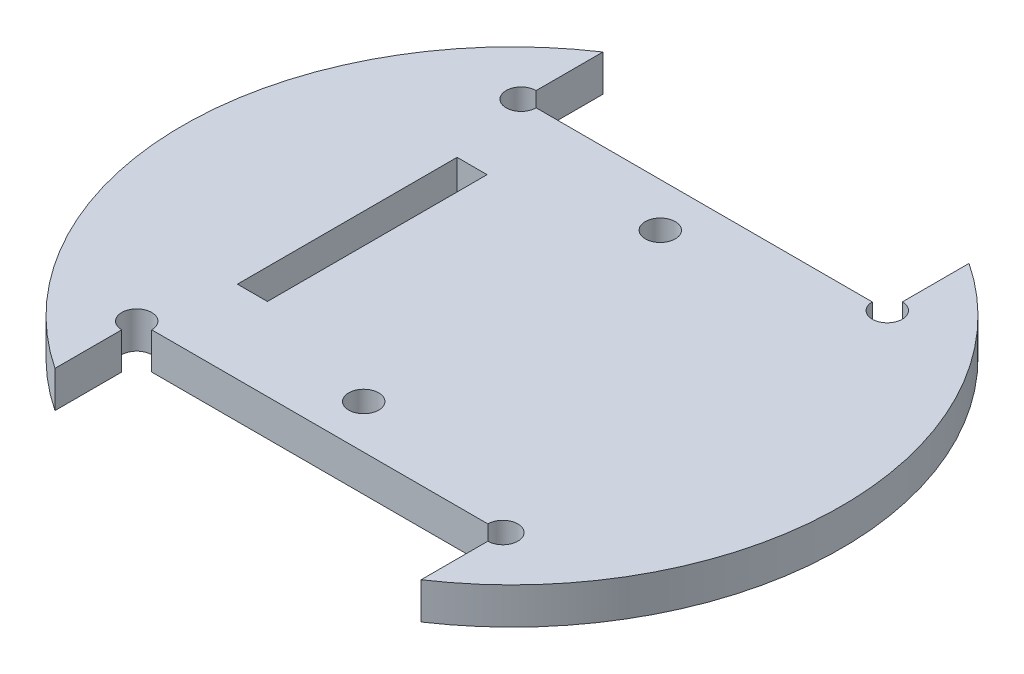
ISO-10303-21;
HEADER;
FILE_DESCRIPTION(('STEP AP214'),'2;1');
FILE_NAME('part.step','',(''),(''),'','','');
FILE_SCHEMA(('AUTOMOTIVE_DESIGN { 1 0 10303 214 1 1 1 1 }'));
ENDSEC;
DATA;
#1=APPLICATION_CONTEXT('core data for automotive mechanical design processes');
#2=APPLICATION_PROTOCOL_DEFINITION('international standard','automotive_design',2000,#1);
#3=PRODUCT_CONTEXT('',#1,'mechanical');
#4=PRODUCT('Part','Part','',(#3));
#5=PRODUCT_RELATED_PRODUCT_CATEGORY('part','',(#4));
#6=PRODUCT_DEFINITION_FORMATION('','',#4);
#7=PRODUCT_DEFINITION_CONTEXT('part definition',#1,'design');
#8=PRODUCT_DEFINITION('design','',#6,#7);
#9=PRODUCT_DEFINITION_SHAPE('','',#8);
#10=(LENGTH_UNIT() NAMED_UNIT(*) SI_UNIT(.MILLI.,.METRE.));
#11=(NAMED_UNIT(*) PLANE_ANGLE_UNIT() SI_UNIT($,.RADIAN.));
#12=(NAMED_UNIT(*) SI_UNIT($,.STERADIAN.) SOLID_ANGLE_UNIT());
#13=UNCERTAINTY_MEASURE_WITH_UNIT(LENGTH_MEASURE(1.E-05),#10,'distance_accuracy_value','');
#14=(GEOMETRIC_REPRESENTATION_CONTEXT(3) GLOBAL_UNCERTAINTY_ASSIGNED_CONTEXT((#13)) GLOBAL_UNIT_ASSIGNED_CONTEXT((#10,
#11,#12)) REPRESENTATION_CONTEXT('',''));
#15=CARTESIAN_POINT('',(0.,0.,0.));
#16=DIRECTION('',(0.,0.,1.));
#17=DIRECTION('',(1.,0.,0.));
#18=AXIS2_PLACEMENT_3D('',#15,#16,#17);
#19=CARTESIAN_POINT('',(0.,2.5,0.));
#20=DIRECTION('',(0.,-1.,0.));
#21=DIRECTION('',(0.,0.,-1.));
#22=AXIS2_PLACEMENT_3D('',#19,#20,#21);
#23=CYLINDRICAL_SURFACE('',#22,45.);
#24=CARTESIAN_POINT('',(0.,-2.5,0.));
#25=DIRECTION('',(0.,1.,0.));
#26=DIRECTION('',(0.,0.,1.));
#27=AXIS2_PLACEMENT_3D('',#24,#25,#26);
#28=CIRCLE('',#27,45.);
#29=CARTESIAN_POINT('',(25.,-2.5,37.4165738677394));
#30=VERTEX_POINT('',#29);
#31=CARTESIAN_POINT('',(25.,-2.5,-37.4165738677394));
#32=VERTEX_POINT('',#31);
#33=EDGE_CURVE('E212',#30,#32,#28,.T.);
#34=ORIENTED_EDGE('',*,*,#33,.T.);
#35=DIRECTION('',(0.,-1.,0.));
#36=VECTOR('',#35,1.);
#37=CARTESIAN_POINT('',(25.,2.5,-37.4165738677394));
#38=LINE('',#37,#36);
#39=CARTESIAN_POINT('',(25.,2.5,-37.4165738677394));
#40=VERTEX_POINT('',#39);
#41=EDGE_CURVE('E11',#40,#32,#38,.T.);
#42=ORIENTED_EDGE('',*,*,#41,.F.);
#43=CARTESIAN_POINT('',(0.,2.5,0.));
#44=DIRECTION('',(0.,1.,0.));
#45=DIRECTION('',(0.,0.,1.));
#46=AXIS2_PLACEMENT_3D('',#43,#44,#45);
#47=CIRCLE('',#46,45.);
#48=CARTESIAN_POINT('',(25.,2.5,37.4165738677394));
#49=VERTEX_POINT('',#48);
#50=EDGE_CURVE('E180',#49,#40,#47,.T.);
#51=ORIENTED_EDGE('',*,*,#50,.F.);
#52=DIRECTION('',(0.,-1.,0.));
#53=VECTOR('',#52,1.);
#54=CARTESIAN_POINT('',(25.,2.5,37.4165738677394));
#55=LINE('',#54,#53);
#56=EDGE_CURVE('E186',#49,#30,#55,.T.);
#57=ORIENTED_EDGE('',*,*,#56,.T.);
#58=EDGE_LOOP('',(#34,#42,#51,#57));
#59=FACE_BOUND('',#58,.T.);
#60=ADVANCED_FACE('F37',(#59),#23,.T.);
#61=CARTESIAN_POINT('',(25.,2.5,-37.4165738677394));
#62=DIRECTION('',(1.,0.,0.));
#63=DIRECTION('',(0.,0.,-1.));
#64=AXIS2_PLACEMENT_3D('',#61,#62,#63);
#65=PLANE('',#64);
#66=DIRECTION('',(0.,0.,1.));
#67=VECTOR('',#66,1.);
#68=CARTESIAN_POINT('',(25.,-2.5,-37.4165738677394));
#69=LINE('',#68,#67);
#70=CARTESIAN_POINT('',(25.,-2.5,-28.3));
#71=VERTEX_POINT('',#70);
#72=EDGE_CURVE('E209',#32,#71,#69,.T.);
#73=ORIENTED_EDGE('',*,*,#72,.T.);
#74=DIRECTION('',(0.,1.,0.));
#75=VECTOR('',#74,1.);
#76=CARTESIAN_POINT('',(25.,-2.501,-28.3));
#77=LINE('',#76,#75);
#78=CARTESIAN_POINT('',(25.,2.5,-28.3));
#79=VERTEX_POINT('',#78);
#80=EDGE_CURVE('E51',#79,#71,#77,.F.);
#81=ORIENTED_EDGE('',*,*,#80,.F.);
#82=DIRECTION('',(0.,0.,1.));
#83=VECTOR('',#82,1.);
#84=CARTESIAN_POINT('',(25.,2.5,-37.4165738677394));
#85=LINE('',#84,#83);
#86=EDGE_CURVE('E227',#40,#79,#85,.T.);
#87=ORIENTED_EDGE('',*,*,#86,.F.);
#88=ORIENTED_EDGE('',*,*,#41,.T.);
#89=EDGE_LOOP('',(#73,#81,#87,#88));
#90=FACE_BOUND('',#89,.T.);
#91=ADVANCED_FACE('F313',(#90),#65,.F.);
#92=CARTESIAN_POINT('',(-25.,2.5,-26.25));
#93=DIRECTION('',(0.,0.,1.));
#94=DIRECTION('',(1.,0.,0.));
#95=AXIS2_PLACEMENT_3D('',#92,#93,#94);
#96=PLANE('',#95);
#97=DIRECTION('',(-1.,0.,0.));
#98=VECTOR('',#97,1.);
#99=CARTESIAN_POINT('',(-25.,2.5,-26.25));
#100=LINE('',#99,#98);
#101=CARTESIAN_POINT('',(22.95,2.5,-26.25));
#102=VERTEX_POINT('',#101);
#103=CARTESIAN_POINT('',(-22.95,2.5,-26.25));
#104=VERTEX_POINT('',#103);
#105=EDGE_CURVE('E224',#102,#104,#100,.T.);
#106=ORIENTED_EDGE('',*,*,#105,.F.);
#107=DIRECTION('',(0.,1.,0.));
#108=VECTOR('',#107,1.);
#109=CARTESIAN_POINT('',(22.95,-2.501,-26.25));
#110=LINE('',#109,#108);
#111=CARTESIAN_POINT('',(22.95,-2.5,-26.25));
#112=VERTEX_POINT('',#111);
#113=EDGE_CURVE('E280',#112,#102,#110,.T.);
#114=ORIENTED_EDGE('',*,*,#113,.F.);
#115=DIRECTION('',(-1.,0.,0.));
#116=VECTOR('',#115,1.);
#117=CARTESIAN_POINT('',(-25.,-2.5,-26.25));
#118=LINE('',#117,#116);
#119=CARTESIAN_POINT('',(-22.95,-2.5,-26.25));
#120=VERTEX_POINT('',#119);
#121=EDGE_CURVE('E204',#112,#120,#118,.T.);
#122=ORIENTED_EDGE('',*,*,#121,.T.);
#123=DIRECTION('',(0.,1.,0.));
#124=VECTOR('',#123,1.);
#125=CARTESIAN_POINT('',(-22.95,-2.501,-26.25));
#126=LINE('',#125,#124);
#127=EDGE_CURVE('E59',#104,#120,#126,.F.);
#128=ORIENTED_EDGE('',*,*,#127,.F.);
#129=EDGE_LOOP('',(#106,#114,#122,#128));
#130=FACE_BOUND('',#129,.T.);
#131=ADVANCED_FACE('F308',(#130),#96,.F.);
#132=CARTESIAN_POINT('',(-25.,2.5,-37.4165738677394));
#133=DIRECTION('',(-1.,0.,0.));
#134=DIRECTION('',(0.,0.,1.));
#135=AXIS2_PLACEMENT_3D('',#132,#133,#134);
#136=PLANE('',#135);
#137=DIRECTION('',(0.,0.,-1.));
#138=VECTOR('',#137,1.);
#139=CARTESIAN_POINT('',(-25.,2.5,-37.4165738677394));
#140=LINE('',#139,#138);
#141=CARTESIAN_POINT('',(-25.,2.5,-28.3));
#142=VERTEX_POINT('',#141);
#143=CARTESIAN_POINT('',(-25.,2.5,-37.4165738677394));
#144=VERTEX_POINT('',#143);
#145=EDGE_CURVE('E222',#142,#144,#140,.T.);
#146=ORIENTED_EDGE('',*,*,#145,.F.);
#147=DIRECTION('',(0.,1.,0.));
#148=VECTOR('',#147,1.);
#149=CARTESIAN_POINT('',(-25.,-2.501,-28.3));
#150=LINE('',#149,#148);
#151=CARTESIAN_POINT('',(-25.,-2.5,-28.3));
#152=VERTEX_POINT('',#151);
#153=EDGE_CURVE('E170',#152,#142,#150,.T.);
#154=ORIENTED_EDGE('',*,*,#153,.F.);
#155=DIRECTION('',(0.,0.,-1.));
#156=VECTOR('',#155,1.);
#157=CARTESIAN_POINT('',(-25.,-2.5,-37.4165738677394));
#158=LINE('',#157,#156);
#159=CARTESIAN_POINT('',(-25.,-2.5,-37.4165738677394));
#160=VERTEX_POINT('',#159);
#161=EDGE_CURVE('E203',#152,#160,#158,.T.);
#162=ORIENTED_EDGE('',*,*,#161,.T.);
#163=DIRECTION('',(0.,-1.,0.));
#164=VECTOR('',#163,1.);
#165=CARTESIAN_POINT('',(-25.,2.5,-37.4165738677394));
#166=LINE('',#165,#164);
#167=EDGE_CURVE('E44',#144,#160,#166,.T.);
#168=ORIENTED_EDGE('',*,*,#167,.F.);
#169=EDGE_LOOP('',(#146,#154,#162,#168));
#170=FACE_BOUND('',#169,.T.);
#171=ADVANCED_FACE('F303',(#170),#136,.F.);
#172=CARTESIAN_POINT('',(0.,2.5,0.));
#173=DIRECTION('',(0.,-1.,0.));
#174=DIRECTION('',(0.,0.,-1.));
#175=AXIS2_PLACEMENT_3D('',#172,#173,#174);
#176=CYLINDRICAL_SURFACE('',#175,45.);
#177=CARTESIAN_POINT('',(0.,-2.5,0.));
#178=DIRECTION('',(0.,1.,0.));
#179=DIRECTION('',(0.,0.,1.));
#180=AXIS2_PLACEMENT_3D('',#177,#178,#179);
#181=CIRCLE('',#180,45.);
#182=CARTESIAN_POINT('',(-25.,-2.5,37.4165738677394));
#183=VERTEX_POINT('',#182);
#184=EDGE_CURVE('E182',#160,#183,#181,.T.);
#185=ORIENTED_EDGE('',*,*,#184,.T.);
#186=DIRECTION('',(0.,-1.,0.));
#187=VECTOR('',#186,1.);
#188=CARTESIAN_POINT('',(-25.,2.5,37.4165738677394));
#189=LINE('',#188,#187);
#190=CARTESIAN_POINT('',(-25.,2.5,37.4165738677394));
#191=VERTEX_POINT('',#190);
#192=EDGE_CURVE('E189',#191,#183,#189,.T.);
#193=ORIENTED_EDGE('',*,*,#192,.F.);
#194=CARTESIAN_POINT('',(0.,2.5,0.));
#195=DIRECTION('',(0.,1.,0.));
#196=DIRECTION('',(0.,0.,1.));
#197=AXIS2_PLACEMENT_3D('',#194,#195,#196);
#198=CIRCLE('',#197,45.);
#199=EDGE_CURVE('E199',#144,#191,#198,.T.);
#200=ORIENTED_EDGE('',*,*,#199,.F.);
#201=ORIENTED_EDGE('',*,*,#167,.T.);
#202=EDGE_LOOP('',(#185,#193,#200,#201));
#203=FACE_BOUND('',#202,.T.);
#204=ADVANCED_FACE('F197',(#203),#176,.T.);
#205=CARTESIAN_POINT('',(-25.,2.5,37.4165738677394));
#206=DIRECTION('',(-1.,0.,0.));
#207=DIRECTION('',(0.,0.,1.));
#208=AXIS2_PLACEMENT_3D('',#205,#206,#207);
#209=PLANE('',#208);
#210=DIRECTION('',(0.,0.,-1.));
#211=VECTOR('',#210,1.);
#212=CARTESIAN_POINT('',(-25.,-2.5,37.4165738677394));
#213=LINE('',#212,#211);
#214=CARTESIAN_POINT('',(-25.,-2.5,28.3));
#215=VERTEX_POINT('',#214);
#216=EDGE_CURVE('E178',#183,#215,#213,.T.);
#217=ORIENTED_EDGE('',*,*,#216,.T.);
#218=DIRECTION('',(0.,1.,0.));
#219=VECTOR('',#218,1.);
#220=CARTESIAN_POINT('',(-25.,-2.501,28.3));
#221=LINE('',#220,#219);
#222=CARTESIAN_POINT('',(-25.,2.5,28.3));
#223=VERTEX_POINT('',#222);
#224=EDGE_CURVE('E154',#223,#215,#221,.F.);
#225=ORIENTED_EDGE('',*,*,#224,.F.);
#226=DIRECTION('',(0.,0.,-1.));
#227=VECTOR('',#226,1.);
#228=CARTESIAN_POINT('',(-25.,2.5,37.4165738677394));
#229=LINE('',#228,#227);
#230=EDGE_CURVE('E218',#191,#223,#229,.T.);
#231=ORIENTED_EDGE('',*,*,#230,.F.);
#232=ORIENTED_EDGE('',*,*,#192,.T.);
#233=EDGE_LOOP('',(#217,#225,#231,#232));
#234=FACE_BOUND('',#233,.T.);
#235=ADVANCED_FACE('F297',(#234),#209,.F.);
#236=CARTESIAN_POINT('',(-25.,2.5,26.25));
#237=DIRECTION('',(0.,0.,-1.));
#238=DIRECTION('',(-1.,0.,0.));
#239=AXIS2_PLACEMENT_3D('',#236,#237,#238);
#240=PLANE('',#239);
#241=DIRECTION('',(1.,0.,0.));
#242=VECTOR('',#241,1.);
#243=CARTESIAN_POINT('',(-25.,-2.5,26.25));
#244=LINE('',#243,#242);
#245=CARTESIAN_POINT('',(-22.95,-2.5,26.25));
#246=VERTEX_POINT('',#245);
#247=CARTESIAN_POINT('',(22.95,-2.5,26.25));
#248=VERTEX_POINT('',#247);
#249=EDGE_CURVE('E167',#246,#248,#244,.T.);
#250=ORIENTED_EDGE('',*,*,#249,.T.);
#251=DIRECTION('',(0.,1.,0.));
#252=VECTOR('',#251,1.);
#253=CARTESIAN_POINT('',(22.95,-2.501,26.25));
#254=LINE('',#253,#252);
#255=CARTESIAN_POINT('',(22.95,2.5,26.25));
#256=VERTEX_POINT('',#255);
#257=EDGE_CURVE('E288',#256,#248,#254,.F.);
#258=ORIENTED_EDGE('',*,*,#257,.F.);
#259=DIRECTION('',(1.,0.,0.));
#260=VECTOR('',#259,1.);
#261=CARTESIAN_POINT('',(-25.,2.5,26.25));
#262=LINE('',#261,#260);
#263=CARTESIAN_POINT('',(-22.95,2.5,26.25));
#264=VERTEX_POINT('',#263);
#265=EDGE_CURVE('E169',#264,#256,#262,.T.);
#266=ORIENTED_EDGE('',*,*,#265,.F.);
#267=DIRECTION('',(0.,1.,0.));
#268=VECTOR('',#267,1.);
#269=CARTESIAN_POINT('',(-22.95,-2.501,26.25));
#270=LINE('',#269,#268);
#271=EDGE_CURVE('E151',#246,#264,#270,.T.);
#272=ORIENTED_EDGE('',*,*,#271,.F.);
#273=EDGE_LOOP('',(#250,#258,#266,#272));
#274=FACE_BOUND('',#273,.T.);
#275=ADVANCED_FACE('F165',(#274),#240,.F.);
#276=CARTESIAN_POINT('',(25.,2.5,37.4165738677394));
#277=DIRECTION('',(1.,0.,0.));
#278=DIRECTION('',(0.,0.,-1.));
#279=AXIS2_PLACEMENT_3D('',#276,#277,#278);
#280=PLANE('',#279);
#281=DIRECTION('',(0.,0.,1.));
#282=VECTOR('',#281,1.);
#283=CARTESIAN_POINT('',(25.,2.5,37.4165738677394));
#284=LINE('',#283,#282);
#285=CARTESIAN_POINT('',(25.,2.5,28.3));
#286=VERTEX_POINT('',#285);
#287=EDGE_CURVE('E190',#286,#49,#284,.T.);
#288=ORIENTED_EDGE('',*,*,#287,.F.);
#289=DIRECTION('',(0.,1.,0.));
#290=VECTOR('',#289,1.);
#291=CARTESIAN_POINT('',(25.,-2.501,28.3));
#292=LINE('',#291,#290);
#293=CARTESIAN_POINT('',(25.,-2.5,28.3));
#294=VERTEX_POINT('',#293);
#295=EDGE_CURVE('E160',#294,#286,#292,.T.);
#296=ORIENTED_EDGE('',*,*,#295,.F.);
#297=DIRECTION('',(0.,0.,1.));
#298=VECTOR('',#297,1.);
#299=CARTESIAN_POINT('',(25.,-2.5,37.4165738677394));
#300=LINE('',#299,#298);
#301=EDGE_CURVE('E177',#294,#30,#300,.T.);
#302=ORIENTED_EDGE('',*,*,#301,.T.);
#303=ORIENTED_EDGE('',*,*,#56,.F.);
#304=EDGE_LOOP('',(#288,#296,#302,#303));
#305=FACE_BOUND('',#304,.T.);
#306=ADVANCED_FACE('F319',(#305),#280,.F.);
#307=CARTESIAN_POINT('',(0.,2.5,0.));
#308=DIRECTION('',(0.,1.,0.));
#309=DIRECTION('',(0.,0.,1.));
#310=AXIS2_PLACEMENT_3D('',#307,#308,#309);
#311=PLANE('',#310);
#312=CARTESIAN_POINT('',(25.,2.5,-26.25));
#313=DIRECTION('',(0.,1.,0.));
#314=DIRECTION('',(0.,0.,1.));
#315=AXIS2_PLACEMENT_3D('',#312,#313,#314);
#316=CIRCLE('',#315,2.05);
#317=EDGE_CURVE('E283',#102,#79,#316,.T.);
#318=ORIENTED_EDGE('',*,*,#317,.F.);
#319=ORIENTED_EDGE('',*,*,#105,.T.);
#320=CARTESIAN_POINT('',(-25.,2.5,-26.25));
#321=DIRECTION('',(0.,1.,0.));
#322=DIRECTION('',(0.,0.,1.));
#323=AXIS2_PLACEMENT_3D('',#320,#321,#322);
#324=CIRCLE('',#323,2.05);
#325=EDGE_CURVE('E276',#142,#104,#324,.T.);
#326=ORIENTED_EDGE('',*,*,#325,.F.);
#327=ORIENTED_EDGE('',*,*,#145,.T.);
#328=ORIENTED_EDGE('',*,*,#199,.T.);
#329=ORIENTED_EDGE('',*,*,#230,.T.);
#330=CARTESIAN_POINT('',(-25.,2.5,26.25));
#331=DIRECTION('',(0.,1.,0.));
#332=DIRECTION('',(0.,0.,1.));
#333=AXIS2_PLACEMENT_3D('',#330,#331,#332);
#334=CIRCLE('',#333,2.05);
#335=EDGE_CURVE('E159',#264,#223,#334,.T.);
#336=ORIENTED_EDGE('',*,*,#335,.F.);
#337=ORIENTED_EDGE('',*,*,#265,.T.);
#338=CARTESIAN_POINT('',(25.,2.5,26.25));
#339=DIRECTION('',(0.,1.,0.));
#340=DIRECTION('',(0.,0.,1.));
#341=AXIS2_PLACEMENT_3D('',#338,#339,#340);
#342=CIRCLE('',#341,2.05);
#343=EDGE_CURVE('E290',#286,#256,#342,.T.);
#344=ORIENTED_EDGE('',*,*,#343,.F.);
#345=ORIENTED_EDGE('',*,*,#287,.T.);
#346=ORIENTED_EDGE('',*,*,#50,.T.);
#347=ORIENTED_EDGE('',*,*,#86,.T.);
#348=EDGE_LOOP('',(#318,#319,#326,#327,#328,#329,#336,#337,#344,#345,#346,#347));
#349=FACE_BOUND('',#348,.T.);
#350=DIRECTION('',(0.,0.,-1.));
#351=VECTOR('',#350,1.);
#352=CARTESIAN_POINT('',(-18.4,2.5,15.));
#353=LINE('',#352,#351);
#354=CARTESIAN_POINT('',(-18.4,2.5,15.));
#355=VERTEX_POINT('',#354);
#356=CARTESIAN_POINT('',(-18.4,2.5,-15.));
#357=VERTEX_POINT('',#356);
#358=EDGE_CURVE('E264',#355,#357,#353,.T.);
#359=ORIENTED_EDGE('',*,*,#358,.F.);
#360=DIRECTION('',(1.,0.,0.));
#361=VECTOR('',#360,1.);
#362=CARTESIAN_POINT('',(-22.5,2.5,15.));
#363=LINE('',#362,#361);
#364=CARTESIAN_POINT('',(-22.5,2.5,15.));
#365=VERTEX_POINT('',#364);
#366=EDGE_CURVE('E251',#365,#355,#363,.T.);
#367=ORIENTED_EDGE('',*,*,#366,.F.);
#368=DIRECTION('',(0.,0.,1.));
#369=VECTOR('',#368,1.);
#370=CARTESIAN_POINT('',(-22.5,2.5,15.));
#371=LINE('',#370,#369);
#372=CARTESIAN_POINT('',(-22.5,2.5,-15.));
#373=VERTEX_POINT('',#372);
#374=EDGE_CURVE('E258',#373,#365,#371,.T.);
#375=ORIENTED_EDGE('',*,*,#374,.F.);
#376=DIRECTION('',(-1.,0.,0.));
#377=VECTOR('',#376,1.);
#378=CARTESIAN_POINT('',(-22.5,2.5,-15.));
#379=LINE('',#378,#377);
#380=EDGE_CURVE('E261',#357,#373,#379,.T.);
#381=ORIENTED_EDGE('',*,*,#380,.F.);
#382=EDGE_LOOP('',(#359,#367,#375,#381));
#383=FACE_BOUND('',#382,.T.);
#384=CARTESIAN_POINT('',(0.,2.5,20.25));
#385=DIRECTION('',(0.,1.,0.));
#386=DIRECTION('',(0.,0.,1.));
#387=AXIS2_PLACEMENT_3D('',#384,#385,#386);
#388=CIRCLE('',#387,2.05);
#389=CARTESIAN_POINT('',(0.,2.5,22.3));
#390=VERTEX_POINT('',#389);
#391=EDGE_CURVE('E238',#390,#390,#388,.T.);
#392=ORIENTED_EDGE('',*,*,#391,.F.);
#393=EDGE_LOOP('',(#392));
#394=FACE_BOUND('',#393,.T.);
#395=CARTESIAN_POINT('',(0.,2.5,-20.25));
#396=DIRECTION('',(0.,1.,0.));
#397=DIRECTION('',(0.,0.,1.));
#398=AXIS2_PLACEMENT_3D('',#395,#396,#397);
#399=CIRCLE('',#398,2.05);
#400=CARTESIAN_POINT('',(0.,2.5,-18.2));
#401=VERTEX_POINT('',#400);
#402=EDGE_CURVE('E232',#401,#401,#399,.T.);
#403=ORIENTED_EDGE('',*,*,#402,.F.);
#404=EDGE_LOOP('',(#403));
#405=FACE_BOUND('',#404,.T.);
#406=ADVANCED_FACE('F299',(#349,#383,#394,#405),#311,.T.);
#407=CARTESIAN_POINT('',(0.,-2.5,0.));
#408=DIRECTION('',(0.,1.,0.));
#409=DIRECTION('',(0.,0.,1.));
#410=AXIS2_PLACEMENT_3D('',#407,#408,#409);
#411=PLANE('',#410);
#412=DIRECTION('',(-1.,0.,0.));
#413=VECTOR('',#412,1.);
#414=CARTESIAN_POINT('',(-22.5,-2.5,15.));
#415=LINE('',#414,#413);
#416=CARTESIAN_POINT('',(-18.4,-2.5,15.));
#417=VERTEX_POINT('',#416);
#418=CARTESIAN_POINT('',(-22.5,-2.5,15.));
#419=VERTEX_POINT('',#418);
#420=EDGE_CURVE('E269',#417,#419,#415,.T.);
#421=ORIENTED_EDGE('',*,*,#420,.F.);
#422=DIRECTION('',(0.,0.,1.));
#423=VECTOR('',#422,1.);
#424=CARTESIAN_POINT('',(-18.4,-2.5,15.));
#425=LINE('',#424,#423);
#426=CARTESIAN_POINT('',(-18.4,-2.5,-15.));
#427=VERTEX_POINT('',#426);
#428=EDGE_CURVE('E266',#427,#417,#425,.T.);
#429=ORIENTED_EDGE('',*,*,#428,.F.);
#430=DIRECTION('',(1.,0.,0.));
#431=VECTOR('',#430,1.);
#432=CARTESIAN_POINT('',(-22.5,-2.5,-15.));
#433=LINE('',#432,#431);
#434=CARTESIAN_POINT('',(-22.5,-2.5,-15.));
#435=VERTEX_POINT('',#434);
#436=EDGE_CURVE('E241',#435,#427,#433,.T.);
#437=ORIENTED_EDGE('',*,*,#436,.F.);
#438=DIRECTION('',(0.,0.,-1.));
#439=VECTOR('',#438,1.);
#440=CARTESIAN_POINT('',(-22.5,-2.5,15.));
#441=LINE('',#440,#439);
#442=EDGE_CURVE('E272',#419,#435,#441,.T.);
#443=ORIENTED_EDGE('',*,*,#442,.F.);
#444=EDGE_LOOP('',(#421,#429,#437,#443));
#445=FACE_BOUND('',#444,.T.);
#446=CARTESIAN_POINT('',(0.,-2.5,20.25));
#447=DIRECTION('',(0.,1.,0.));
#448=DIRECTION('',(0.,0.,1.));
#449=AXIS2_PLACEMENT_3D('',#446,#447,#448);
#450=CIRCLE('',#449,2.05);
#451=CARTESIAN_POINT('',(0.,-2.5,22.3));
#452=VERTEX_POINT('',#451);
#453=EDGE_CURVE('E235',#452,#452,#450,.T.);
#454=ORIENTED_EDGE('',*,*,#453,.T.);
#455=EDGE_LOOP('',(#454));
#456=FACE_BOUND('',#455,.T.);
#457=CARTESIAN_POINT('',(0.,-2.5,-20.25));
#458=DIRECTION('',(0.,1.,0.));
#459=DIRECTION('',(0.,0.,1.));
#460=AXIS2_PLACEMENT_3D('',#457,#458,#459);
#461=CIRCLE('',#460,2.05);
#462=CARTESIAN_POINT('',(0.,-2.5,-18.2));
#463=VERTEX_POINT('',#462);
#464=EDGE_CURVE('E215',#463,#463,#461,.T.);
#465=ORIENTED_EDGE('',*,*,#464,.T.);
#466=EDGE_LOOP('',(#465));
#467=FACE_BOUND('',#466,.T.);
#468=ORIENTED_EDGE('',*,*,#121,.F.);
#469=CARTESIAN_POINT('',(25.,-2.5,-26.25));
#470=DIRECTION('',(0.,1.,0.));
#471=DIRECTION('',(0.,0.,1.));
#472=AXIS2_PLACEMENT_3D('',#469,#470,#471);
#473=CIRCLE('',#472,2.05);
#474=EDGE_CURVE('E285',#71,#112,#473,.F.);
#475=ORIENTED_EDGE('',*,*,#474,.F.);
#476=ORIENTED_EDGE('',*,*,#72,.F.);
#477=ORIENTED_EDGE('',*,*,#33,.F.);
#478=ORIENTED_EDGE('',*,*,#301,.F.);
#479=CARTESIAN_POINT('',(25.,-2.5,26.25));
#480=DIRECTION('',(0.,1.,0.));
#481=DIRECTION('',(0.,0.,1.));
#482=AXIS2_PLACEMENT_3D('',#479,#480,#481);
#483=CIRCLE('',#482,2.05);
#484=EDGE_CURVE('E176',#248,#294,#483,.F.);
#485=ORIENTED_EDGE('',*,*,#484,.F.);
#486=ORIENTED_EDGE('',*,*,#249,.F.);
#487=CARTESIAN_POINT('',(-25.,-2.5,26.25));
#488=DIRECTION('',(0.,1.,0.));
#489=DIRECTION('',(0.,0.,1.));
#490=AXIS2_PLACEMENT_3D('',#487,#488,#489);
#491=CIRCLE('',#490,2.05);
#492=EDGE_CURVE('E148',#215,#246,#491,.F.);
#493=ORIENTED_EDGE('',*,*,#492,.F.);
#494=ORIENTED_EDGE('',*,*,#216,.F.);
#495=ORIENTED_EDGE('',*,*,#184,.F.);
#496=ORIENTED_EDGE('',*,*,#161,.F.);
#497=CARTESIAN_POINT('',(-25.,-2.5,-26.25));
#498=DIRECTION('',(0.,1.,0.));
#499=DIRECTION('',(0.,0.,1.));
#500=AXIS2_PLACEMENT_3D('',#497,#498,#499);
#501=CIRCLE('',#500,2.05);
#502=EDGE_CURVE('E274',#120,#152,#501,.F.);
#503=ORIENTED_EDGE('',*,*,#502,.F.);
#504=EDGE_LOOP('',(#468,#475,#476,#477,#478,#485,#486,#493,#494,#495,#496,#503));
#505=FACE_BOUND('',#504,.T.);
#506=ADVANCED_FACE('F174',(#445,#456,#467,#505),#411,.F.);
#507=CARTESIAN_POINT('',(0.,-2.5,-20.25));
#508=DIRECTION('',(0.,1.,0.));
#509=DIRECTION('',(0.,0.,1.));
#510=AXIS2_PLACEMENT_3D('',#507,#508,#509);
#511=CYLINDRICAL_SURFACE('',#510,2.05);
#512=ORIENTED_EDGE('',*,*,#464,.F.);
#513=EDGE_LOOP('',(#512));
#514=FACE_BOUND('',#513,.T.);
#515=ORIENTED_EDGE('',*,*,#402,.T.);
#516=EDGE_LOOP('',(#515));
#517=FACE_BOUND('',#516,.T.);
#518=ADVANCED_FACE('F354',(#514,#517),#511,.F.);
#519=CARTESIAN_POINT('',(0.,-2.5,20.25));
#520=DIRECTION('',(0.,1.,0.));
#521=DIRECTION('',(0.,0.,1.));
#522=AXIS2_PLACEMENT_3D('',#519,#520,#521);
#523=CYLINDRICAL_SURFACE('',#522,2.05);
#524=ORIENTED_EDGE('',*,*,#453,.F.);
#525=EDGE_LOOP('',(#524));
#526=FACE_BOUND('',#525,.T.);
#527=ORIENTED_EDGE('',*,*,#391,.T.);
#528=EDGE_LOOP('',(#527));
#529=FACE_BOUND('',#528,.T.);
#530=ADVANCED_FACE('F360',(#526,#529),#523,.F.);
#531=CARTESIAN_POINT('',(-18.4,-2.501,15.));
#532=DIRECTION('',(1.,0.,0.));
#533=DIRECTION('',(0.,0.,-1.));
#534=AXIS2_PLACEMENT_3D('',#531,#532,#533);
#535=PLANE('',#534);
#536=ORIENTED_EDGE('',*,*,#428,.T.);
#537=DIRECTION('',(0.,1.,0.));
#538=VECTOR('',#537,1.);
#539=CARTESIAN_POINT('',(-18.4,-2.501,15.));
#540=LINE('',#539,#538);
#541=EDGE_CURVE('E246',#417,#355,#540,.T.);
#542=ORIENTED_EDGE('',*,*,#541,.T.);
#543=ORIENTED_EDGE('',*,*,#358,.T.);
#544=DIRECTION('',(0.,1.,0.));
#545=VECTOR('',#544,1.);
#546=CARTESIAN_POINT('',(-18.4,-2.501,-15.));
#547=LINE('',#546,#545);
#548=EDGE_CURVE('E247',#427,#357,#547,.T.);
#549=ORIENTED_EDGE('',*,*,#548,.F.);
#550=EDGE_LOOP('',(#536,#542,#543,#549));
#551=FACE_BOUND('',#550,.T.);
#552=ADVANCED_FACE('F364',(#551),#535,.F.);
#553=CARTESIAN_POINT('',(-22.5,-2.501,15.));
#554=DIRECTION('',(0.,0.,1.));
#555=DIRECTION('',(1.,0.,0.));
#556=AXIS2_PLACEMENT_3D('',#553,#554,#555);
#557=PLANE('',#556);
#558=ORIENTED_EDGE('',*,*,#420,.T.);
#559=DIRECTION('',(0.,1.,0.));
#560=VECTOR('',#559,1.);
#561=CARTESIAN_POINT('',(-22.5,-2.501,15.));
#562=LINE('',#561,#560);
#563=EDGE_CURVE('E253',#419,#365,#562,.T.);
#564=ORIENTED_EDGE('',*,*,#563,.T.);
#565=ORIENTED_EDGE('',*,*,#366,.T.);
#566=ORIENTED_EDGE('',*,*,#541,.F.);
#567=EDGE_LOOP('',(#558,#564,#565,#566));
#568=FACE_BOUND('',#567,.T.);
#569=ADVANCED_FACE('F368',(#568),#557,.F.);
#570=CARTESIAN_POINT('',(-22.5,-2.501,15.));
#571=DIRECTION('',(-1.,0.,0.));
#572=DIRECTION('',(0.,0.,1.));
#573=AXIS2_PLACEMENT_3D('',#570,#571,#572);
#574=PLANE('',#573);
#575=ORIENTED_EDGE('',*,*,#442,.T.);
#576=DIRECTION('',(0.,1.,0.));
#577=VECTOR('',#576,1.);
#578=CARTESIAN_POINT('',(-22.5,-2.501,-15.));
#579=LINE('',#578,#577);
#580=EDGE_CURVE('E250',#435,#373,#579,.T.);
#581=ORIENTED_EDGE('',*,*,#580,.T.);
#582=ORIENTED_EDGE('',*,*,#374,.T.);
#583=ORIENTED_EDGE('',*,*,#563,.F.);
#584=EDGE_LOOP('',(#575,#581,#582,#583));
#585=FACE_BOUND('',#584,.T.);
#586=ADVANCED_FACE('F373',(#585),#574,.F.);
#587=CARTESIAN_POINT('',(-22.5,-2.501,-15.));
#588=DIRECTION('',(0.,0.,-1.));
#589=DIRECTION('',(-1.,0.,0.));
#590=AXIS2_PLACEMENT_3D('',#587,#588,#589);
#591=PLANE('',#590);
#592=ORIENTED_EDGE('',*,*,#436,.T.);
#593=ORIENTED_EDGE('',*,*,#548,.T.);
#594=ORIENTED_EDGE('',*,*,#380,.T.);
#595=ORIENTED_EDGE('',*,*,#580,.F.);
#596=EDGE_LOOP('',(#592,#593,#594,#595));
#597=FACE_BOUND('',#596,.T.);
#598=ADVANCED_FACE('F370',(#597),#591,.F.);
#599=CARTESIAN_POINT('',(-25.,-2.501,-26.25));
#600=DIRECTION('',(0.,1.,0.));
#601=DIRECTION('',(0.,0.,1.));
#602=AXIS2_PLACEMENT_3D('',#599,#600,#601);
#603=CYLINDRICAL_SURFACE('',#602,2.05);
#604=ORIENTED_EDGE('',*,*,#127,.T.);
#605=ORIENTED_EDGE('',*,*,#502,.T.);
#606=ORIENTED_EDGE('',*,*,#153,.T.);
#607=ORIENTED_EDGE('',*,*,#325,.T.);
#608=EDGE_LOOP('',(#604,#605,#606,#607));
#609=FACE_BOUND('',#608,.T.);
#610=ADVANCED_FACE('F304',(#609),#603,.F.);
#611=CARTESIAN_POINT('',(-25.,-2.501,26.25));
#612=DIRECTION('',(0.,1.,0.));
#613=DIRECTION('',(0.,0.,1.));
#614=AXIS2_PLACEMENT_3D('',#611,#612,#613);
#615=CYLINDRICAL_SURFACE('',#614,2.05);
#616=ORIENTED_EDGE('',*,*,#224,.T.);
#617=ORIENTED_EDGE('',*,*,#492,.T.);
#618=ORIENTED_EDGE('',*,*,#271,.T.);
#619=ORIENTED_EDGE('',*,*,#335,.T.);
#620=EDGE_LOOP('',(#616,#617,#618,#619));
#621=FACE_BOUND('',#620,.T.);
#622=ADVANCED_FACE('F150',(#621),#615,.F.);
#623=CARTESIAN_POINT('',(25.,-2.501,26.25));
#624=DIRECTION('',(0.,1.,0.));
#625=DIRECTION('',(0.,0.,1.));
#626=AXIS2_PLACEMENT_3D('',#623,#624,#625);
#627=CYLINDRICAL_SURFACE('',#626,2.05);
#628=ORIENTED_EDGE('',*,*,#257,.T.);
#629=ORIENTED_EDGE('',*,*,#484,.T.);
#630=ORIENTED_EDGE('',*,*,#295,.T.);
#631=ORIENTED_EDGE('',*,*,#343,.T.);
#632=EDGE_LOOP('',(#628,#629,#630,#631));
#633=FACE_BOUND('',#632,.T.);
#634=ADVANCED_FACE('F323',(#633),#627,.F.);
#635=CARTESIAN_POINT('',(25.,-2.501,-26.25));
#636=DIRECTION('',(0.,1.,0.));
#637=DIRECTION('',(0.,0.,1.));
#638=AXIS2_PLACEMENT_3D('',#635,#636,#637);
#639=CYLINDRICAL_SURFACE('',#638,2.05);
#640=ORIENTED_EDGE('',*,*,#80,.T.);
#641=ORIENTED_EDGE('',*,*,#474,.T.);
#642=ORIENTED_EDGE('',*,*,#113,.T.);
#643=ORIENTED_EDGE('',*,*,#317,.T.);
#644=EDGE_LOOP('',(#640,#641,#642,#643));
#645=FACE_BOUND('',#644,.T.);
#646=ADVANCED_FACE('F309',(#645),#639,.F.);
#647=CLOSED_SHELL('',(#60,#91,#131,#171,#204,#235,#275,#306,#406,#506,#518,#530,#552,#569,#586,
#598,#610,#622,#634,#646));
#648=MANIFOLD_SOLID_BREP('B2',#647);
#649=ADVANCED_BREP_SHAPE_REPRESENTATION('',(#18,#648),#14);
#650=SHAPE_DEFINITION_REPRESENTATION(#9,#649);
ENDSEC;
END-ISO-10303-21;
